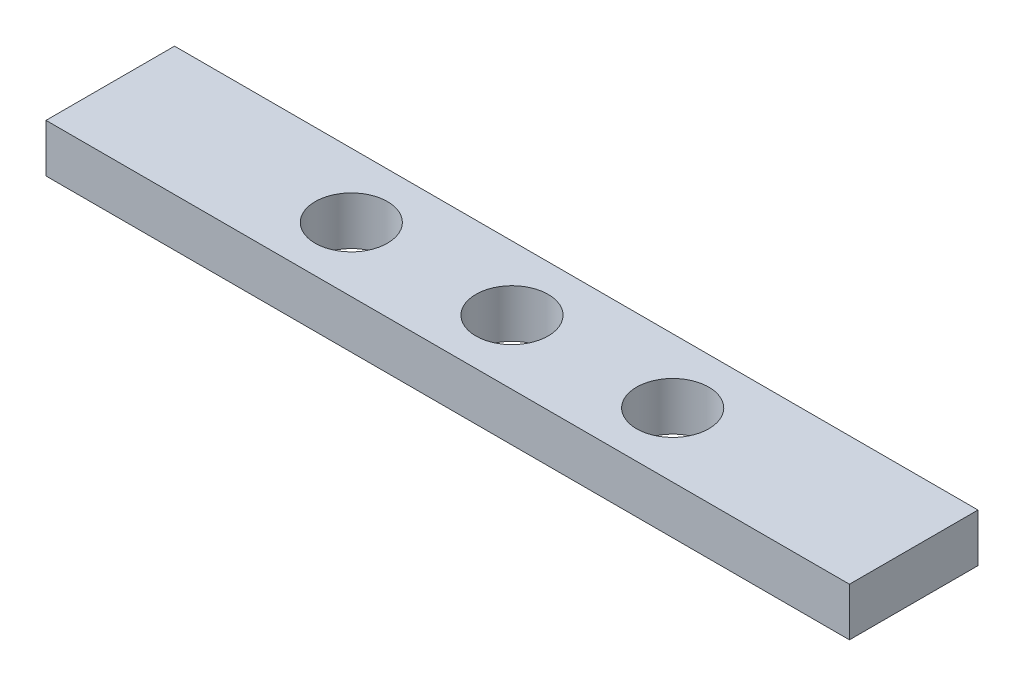
ISO-10303-21;
HEADER;
FILE_DESCRIPTION(('STEP AP214'),'2;1');
FILE_NAME('part.step','',(''),(''),'','','');
FILE_SCHEMA(('AUTOMOTIVE_DESIGN { 1 0 10303 214 1 1 1 1 }'));
ENDSEC;
DATA;
#1=APPLICATION_CONTEXT('core data for automotive mechanical design processes');
#2=APPLICATION_PROTOCOL_DEFINITION('international standard','automotive_design',2000,#1);
#3=PRODUCT_CONTEXT('',#1,'mechanical');
#4=PRODUCT('Part','Part','',(#3));
#5=PRODUCT_RELATED_PRODUCT_CATEGORY('part','',(#4));
#6=PRODUCT_DEFINITION_FORMATION('','',#4);
#7=PRODUCT_DEFINITION_CONTEXT('part definition',#1,'design');
#8=PRODUCT_DEFINITION('design','',#6,#7);
#9=PRODUCT_DEFINITION_SHAPE('','',#8);
#10=(LENGTH_UNIT() NAMED_UNIT(*) SI_UNIT(.MILLI.,.METRE.));
#11=(NAMED_UNIT(*) PLANE_ANGLE_UNIT() SI_UNIT($,.RADIAN.));
#12=(NAMED_UNIT(*) SI_UNIT($,.STERADIAN.) SOLID_ANGLE_UNIT());
#13=UNCERTAINTY_MEASURE_WITH_UNIT(LENGTH_MEASURE(1.E-05),#10,'distance_accuracy_value','');
#14=(GEOMETRIC_REPRESENTATION_CONTEXT(3) GLOBAL_UNCERTAINTY_ASSIGNED_CONTEXT((#13)) GLOBAL_UNIT_ASSIGNED_CONTEXT((#10,
#11,#12)) REPRESENTATION_CONTEXT('',''));
#15=CARTESIAN_POINT('',(0.,0.,0.));
#16=DIRECTION('',(0.,0.,1.));
#17=DIRECTION('',(1.,0.,0.));
#18=AXIS2_PLACEMENT_3D('',#15,#16,#17);
#19=CARTESIAN_POINT('',(-7.22636700217678,3.,-4.3135593220339));
#20=DIRECTION('',(1.,0.,0.));
#21=DIRECTION('',(0.,0.,-1.));
#22=AXIS2_PLACEMENT_3D('',#19,#20,#21);
#23=PLANE('',#22);
#24=DIRECTION('',(0.,0.,1.));
#25=VECTOR('',#24,1.);
#26=CARTESIAN_POINT('',(-7.22636700217678,0.,-4.3135593220339));
#27=LINE('',#26,#25);
#28=CARTESIAN_POINT('',(-7.22636700217678,0.,-4.3135593220339));
#29=VERTEX_POINT('',#28);
#30=CARTESIAN_POINT('',(-7.22636700217678,0.,3.6864406779661));
#31=VERTEX_POINT('',#30);
#32=EDGE_CURVE('E99',#29,#31,#27,.T.);
#33=ORIENTED_EDGE('',*,*,#32,.T.);
#34=DIRECTION('',(0.,-1.,0.));
#35=VECTOR('',#34,1.);
#36=CARTESIAN_POINT('',(-7.22636700217678,3.,3.6864406779661));
#37=LINE('',#36,#35);
#38=CARTESIAN_POINT('',(-7.22636700217678,3.,3.6864406779661));
#39=VERTEX_POINT('',#38);
#40=EDGE_CURVE('E11',#39,#31,#37,.T.);
#41=ORIENTED_EDGE('',*,*,#40,.F.);
#42=DIRECTION('',(0.,0.,1.));
#43=VECTOR('',#42,1.);
#44=CARTESIAN_POINT('',(-7.22636700217678,3.,-4.3135593220339));
#45=LINE('',#44,#43);
#46=CARTESIAN_POINT('',(-7.22636700217678,3.,-4.3135593220339));
#47=VERTEX_POINT('',#46);
#48=EDGE_CURVE('E86',#47,#39,#45,.T.);
#49=ORIENTED_EDGE('',*,*,#48,.F.);
#50=DIRECTION('',(0.,-1.,0.));
#51=VECTOR('',#50,1.);
#52=CARTESIAN_POINT('',(-7.22636700217678,3.,-4.3135593220339));
#53=LINE('',#52,#51);
#54=EDGE_CURVE('E95',#47,#29,#53,.T.);
#55=ORIENTED_EDGE('',*,*,#54,.T.);
#56=EDGE_LOOP('',(#33,#41,#49,#55));
#57=FACE_BOUND('',#56,.T.);
#58=ADVANCED_FACE('F33',(#57),#23,.F.);
#59=CARTESIAN_POINT('',(-7.22636700217678,3.,3.6864406779661));
#60=DIRECTION('',(0.,0.,-1.));
#61=DIRECTION('',(-1.,0.,0.));
#62=AXIS2_PLACEMENT_3D('',#59,#60,#61);
#63=PLANE('',#62);
#64=DIRECTION('',(1.,0.,0.));
#65=VECTOR('',#64,1.);
#66=CARTESIAN_POINT('',(-7.22636700217678,0.,3.6864406779661));
#67=LINE('',#66,#65);
#68=CARTESIAN_POINT('',(42.7736329978232,0.,3.6864406779661));
#69=VERTEX_POINT('',#68);
#70=EDGE_CURVE('E90',#31,#69,#67,.T.);
#71=ORIENTED_EDGE('',*,*,#70,.T.);
#72=DIRECTION('',(0.,-1.,0.));
#73=VECTOR('',#72,1.);
#74=CARTESIAN_POINT('',(42.7736329978232,3.,3.6864406779661));
#75=LINE('',#74,#73);
#76=CARTESIAN_POINT('',(42.7736329978232,3.,3.6864406779661));
#77=VERTEX_POINT('',#76);
#78=EDGE_CURVE('E42',#77,#69,#75,.T.);
#79=ORIENTED_EDGE('',*,*,#78,.F.);
#80=DIRECTION('',(1.,0.,0.));
#81=VECTOR('',#80,1.);
#82=CARTESIAN_POINT('',(-7.22636700217678,3.,3.6864406779661));
#83=LINE('',#82,#81);
#84=EDGE_CURVE('E81',#39,#77,#83,.T.);
#85=ORIENTED_EDGE('',*,*,#84,.F.);
#86=ORIENTED_EDGE('',*,*,#40,.T.);
#87=EDGE_LOOP('',(#71,#79,#85,#86));
#88=FACE_BOUND('',#87,.T.);
#89=ADVANCED_FACE('F89',(#88),#63,.F.);
#90=CARTESIAN_POINT('',(42.7736329978232,3.,-4.3135593220339));
#91=DIRECTION('',(-1.,0.,0.));
#92=DIRECTION('',(0.,0.,1.));
#93=AXIS2_PLACEMENT_3D('',#90,#91,#92);
#94=PLANE('',#93);
#95=DIRECTION('',(0.,0.,-1.));
#96=VECTOR('',#95,1.);
#97=CARTESIAN_POINT('',(42.7736329978232,0.,-4.3135593220339));
#98=LINE('',#97,#96);
#99=CARTESIAN_POINT('',(42.7736329978232,0.,-4.3135593220339));
#100=VERTEX_POINT('',#99);
#101=EDGE_CURVE('E68',#69,#100,#98,.T.);
#102=ORIENTED_EDGE('',*,*,#101,.T.);
#103=DIRECTION('',(0.,-1.,0.));
#104=VECTOR('',#103,1.);
#105=CARTESIAN_POINT('',(42.7736329978232,3.,-4.3135593220339));
#106=LINE('',#105,#104);
#107=CARTESIAN_POINT('',(42.7736329978232,3.,-4.3135593220339));
#108=VERTEX_POINT('',#107);
#109=EDGE_CURVE('E91',#108,#100,#106,.T.);
#110=ORIENTED_EDGE('',*,*,#109,.F.);
#111=DIRECTION('',(0.,0.,-1.));
#112=VECTOR('',#111,1.);
#113=CARTESIAN_POINT('',(42.7736329978232,3.,-4.3135593220339));
#114=LINE('',#113,#112);
#115=EDGE_CURVE('E84',#77,#108,#114,.T.);
#116=ORIENTED_EDGE('',*,*,#115,.F.);
#117=ORIENTED_EDGE('',*,*,#78,.T.);
#118=EDGE_LOOP('',(#102,#110,#116,#117));
#119=FACE_BOUND('',#118,.T.);
#120=ADVANCED_FACE('F93',(#119),#94,.F.);
#121=CARTESIAN_POINT('',(-7.22636700217678,3.,-4.3135593220339));
#122=DIRECTION('',(0.,0.,1.));
#123=DIRECTION('',(1.,0.,0.));
#124=AXIS2_PLACEMENT_3D('',#121,#122,#123);
#125=PLANE('',#124);
#126=DIRECTION('',(-1.,0.,0.));
#127=VECTOR('',#126,1.);
#128=CARTESIAN_POINT('',(-7.22636700217678,0.,-4.3135593220339));
#129=LINE('',#128,#127);
#130=EDGE_CURVE('E74',#100,#29,#129,.T.);
#131=ORIENTED_EDGE('',*,*,#130,.T.);
#132=ORIENTED_EDGE('',*,*,#54,.F.);
#133=DIRECTION('',(-1.,0.,0.));
#134=VECTOR('',#133,1.);
#135=CARTESIAN_POINT('',(-7.22636700217678,3.,-4.3135593220339));
#136=LINE('',#135,#134);
#137=EDGE_CURVE('E51',#108,#47,#136,.T.);
#138=ORIENTED_EDGE('',*,*,#137,.F.);
#139=ORIENTED_EDGE('',*,*,#109,.T.);
#140=EDGE_LOOP('',(#131,#132,#138,#139));
#141=FACE_BOUND('',#140,.T.);
#142=ADVANCED_FACE('F149',(#141),#125,.F.);
#143=CARTESIAN_POINT('',(0.,3.,0.));
#144=DIRECTION('',(0.,1.,0.));
#145=DIRECTION('',(0.,0.,1.));
#146=AXIS2_PLACEMENT_3D('',#143,#144,#145);
#147=PLANE('',#146);
#148=CARTESIAN_POINT('',(7.77363299782322,3.,-0.313559322033901));
#149=DIRECTION('',(0.,1.,0.));
#150=DIRECTION('',(0.,0.,1.));
#151=AXIS2_PLACEMENT_3D('',#148,#149,#150);
#152=CIRCLE('',#151,2.2479);
#153=CARTESIAN_POINT('',(7.77363299782322,3.,1.9343406779661));
#154=VERTEX_POINT('',#153);
#155=EDGE_CURVE('E120',#154,#154,#152,.T.);
#156=ORIENTED_EDGE('',*,*,#155,.F.);
#157=EDGE_LOOP('',(#156));
#158=FACE_BOUND('',#157,.T.);
#159=CARTESIAN_POINT('',(27.7736329978232,3.,-0.313559322033901));
#160=DIRECTION('',(0.,1.,0.));
#161=DIRECTION('',(0.,0.,1.));
#162=AXIS2_PLACEMENT_3D('',#159,#160,#161);
#163=CIRCLE('',#162,2.2479);
#164=CARTESIAN_POINT('',(27.7736329978232,3.,1.9343406779661));
#165=VERTEX_POINT('',#164);
#166=EDGE_CURVE('E110',#165,#165,#163,.T.);
#167=ORIENTED_EDGE('',*,*,#166,.F.);
#168=EDGE_LOOP('',(#167));
#169=FACE_BOUND('',#168,.T.);
#170=CARTESIAN_POINT('',(17.7736329978232,3.,-0.313559322033901));
#171=DIRECTION('',(0.,1.,0.));
#172=DIRECTION('',(0.,0.,1.));
#173=AXIS2_PLACEMENT_3D('',#170,#171,#172);
#174=CIRCLE('',#173,2.2479);
#175=CARTESIAN_POINT('',(17.7736329978232,3.,1.9343406779661));
#176=VERTEX_POINT('',#175);
#177=EDGE_CURVE('E109',#176,#176,#174,.T.);
#178=ORIENTED_EDGE('',*,*,#177,.F.);
#179=EDGE_LOOP('',(#178));
#180=FACE_BOUND('',#179,.T.);
#181=ORIENTED_EDGE('',*,*,#48,.T.);
#182=ORIENTED_EDGE('',*,*,#84,.T.);
#183=ORIENTED_EDGE('',*,*,#115,.T.);
#184=ORIENTED_EDGE('',*,*,#137,.T.);
#185=EDGE_LOOP('',(#181,#182,#183,#184));
#186=FACE_BOUND('',#185,.T.);
#187=ADVANCED_FACE('F82',(#158,#169,#180,#186),#147,.T.);
#188=CARTESIAN_POINT('',(0.,0.,0.));
#189=DIRECTION('',(0.,1.,0.));
#190=DIRECTION('',(0.,0.,1.));
#191=AXIS2_PLACEMENT_3D('',#188,#189,#190);
#192=PLANE('',#191);
#193=CARTESIAN_POINT('',(7.77363299782322,0.,-0.313559322033901));
#194=DIRECTION('',(0.,1.,0.));
#195=DIRECTION('',(0.,0.,1.));
#196=AXIS2_PLACEMENT_3D('',#193,#194,#195);
#197=CIRCLE('',#196,2.2479);
#198=CARTESIAN_POINT('',(7.77363299782322,0.,1.9343406779661));
#199=VERTEX_POINT('',#198);
#200=EDGE_CURVE('E36',#199,#199,#197,.T.);
#201=ORIENTED_EDGE('',*,*,#200,.T.);
#202=EDGE_LOOP('',(#201));
#203=FACE_BOUND('',#202,.T.);
#204=CARTESIAN_POINT('',(27.7736329978232,0.,-0.313559322033901));
#205=DIRECTION('',(0.,1.,0.));
#206=DIRECTION('',(0.,0.,1.));
#207=AXIS2_PLACEMENT_3D('',#204,#205,#206);
#208=CIRCLE('',#207,2.2479);
#209=CARTESIAN_POINT('',(27.7736329978232,0.,1.9343406779661));
#210=VERTEX_POINT('',#209);
#211=EDGE_CURVE('E107',#210,#210,#208,.T.);
#212=ORIENTED_EDGE('',*,*,#211,.T.);
#213=EDGE_LOOP('',(#212));
#214=FACE_BOUND('',#213,.T.);
#215=CARTESIAN_POINT('',(17.7736329978232,0.,-0.313559322033901));
#216=DIRECTION('',(0.,1.,0.));
#217=DIRECTION('',(0.,0.,1.));
#218=AXIS2_PLACEMENT_3D('',#215,#216,#217);
#219=CIRCLE('',#218,2.2479);
#220=CARTESIAN_POINT('',(17.7736329978232,0.,1.9343406779661));
#221=VERTEX_POINT('',#220);
#222=EDGE_CURVE('E102',#221,#221,#219,.T.);
#223=ORIENTED_EDGE('',*,*,#222,.T.);
#224=EDGE_LOOP('',(#223));
#225=FACE_BOUND('',#224,.T.);
#226=ORIENTED_EDGE('',*,*,#32,.F.);
#227=ORIENTED_EDGE('',*,*,#130,.F.);
#228=ORIENTED_EDGE('',*,*,#101,.F.);
#229=ORIENTED_EDGE('',*,*,#70,.F.);
#230=EDGE_LOOP('',(#226,#227,#228,#229));
#231=FACE_BOUND('',#230,.T.);
#232=ADVANCED_FACE('F126',(#203,#214,#225,#231),#192,.F.);
#233=CARTESIAN_POINT('',(17.7736329978232,3.,-0.313559322033901));
#234=DIRECTION('',(0.,1.,0.));
#235=DIRECTION('',(0.,0.,1.));
#236=AXIS2_PLACEMENT_3D('',#233,#234,#235);
#237=CYLINDRICAL_SURFACE('',#236,2.2479);
#238=ORIENTED_EDGE('',*,*,#177,.T.);
#239=EDGE_LOOP('',(#238));
#240=FACE_BOUND('',#239,.T.);
#241=ORIENTED_EDGE('',*,*,#222,.F.);
#242=EDGE_LOOP('',(#241));
#243=FACE_BOUND('',#242,.T.);
#244=ADVANCED_FACE('F129',(#240,#243),#237,.F.);
#245=CARTESIAN_POINT('',(27.7736329978232,3.,-0.313559322033901));
#246=DIRECTION('',(0.,1.,0.));
#247=DIRECTION('',(0.,0.,1.));
#248=AXIS2_PLACEMENT_3D('',#245,#246,#247);
#249=CYLINDRICAL_SURFACE('',#248,2.2479);
#250=ORIENTED_EDGE('',*,*,#166,.T.);
#251=EDGE_LOOP('',(#250));
#252=FACE_BOUND('',#251,.T.);
#253=ORIENTED_EDGE('',*,*,#211,.F.);
#254=EDGE_LOOP('',(#253));
#255=FACE_BOUND('',#254,.T.);
#256=ADVANCED_FACE('F131',(#252,#255),#249,.F.);
#257=CARTESIAN_POINT('',(7.77363299782322,3.,-0.313559322033901));
#258=DIRECTION('',(0.,1.,0.));
#259=DIRECTION('',(0.,0.,1.));
#260=AXIS2_PLACEMENT_3D('',#257,#258,#259);
#261=CYLINDRICAL_SURFACE('',#260,2.2479);
#262=ORIENTED_EDGE('',*,*,#155,.T.);
#263=EDGE_LOOP('',(#262));
#264=FACE_BOUND('',#263,.T.);
#265=ORIENTED_EDGE('',*,*,#200,.F.);
#266=EDGE_LOOP('',(#265));
#267=FACE_BOUND('',#266,.T.);
#268=ADVANCED_FACE('F138',(#264,#267),#261,.F.);
#269=CLOSED_SHELL('',(#58,#89,#120,#142,#187,#232,#244,#256,#268));
#270=MANIFOLD_SOLID_BREP('B2',#269);
#271=ADVANCED_BREP_SHAPE_REPRESENTATION('',(#18,#270),#14);
#272=SHAPE_DEFINITION_REPRESENTATION(#9,#271);
ENDSEC;
END-ISO-10303-21;
